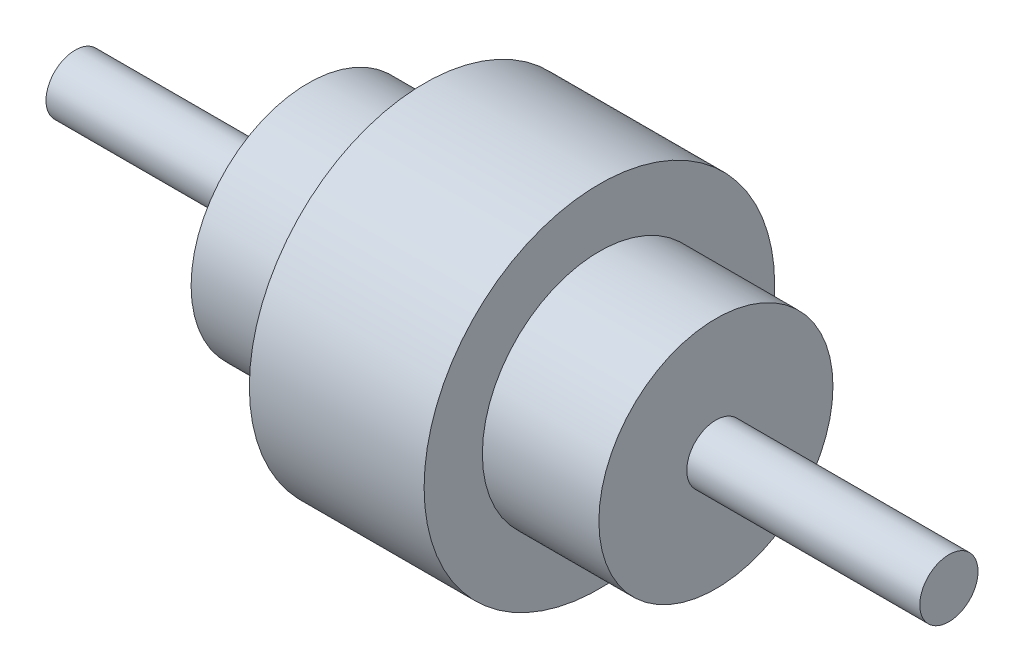
ISO-10303-21;
HEADER;
FILE_DESCRIPTION(('STEP AP214'),'2;1');
FILE_NAME('part.step','',(''),(''),'','','');
FILE_SCHEMA(('AUTOMOTIVE_DESIGN { 1 0 10303 214 1 1 1 1 }'));
ENDSEC;
DATA;
#1=APPLICATION_CONTEXT('core data for automotive mechanical design processes');
#2=APPLICATION_PROTOCOL_DEFINITION('international standard','automotive_design',2000,#1);
#3=PRODUCT_CONTEXT('',#1,'mechanical');
#4=PRODUCT('Part','Part','',(#3));
#5=PRODUCT_RELATED_PRODUCT_CATEGORY('part','',(#4));
#6=PRODUCT_DEFINITION_FORMATION('','',#4);
#7=PRODUCT_DEFINITION_CONTEXT('part definition',#1,'design');
#8=PRODUCT_DEFINITION('design','',#6,#7);
#9=PRODUCT_DEFINITION_SHAPE('','',#8);
#10=(LENGTH_UNIT() NAMED_UNIT(*) SI_UNIT(.MILLI.,.METRE.));
#11=(NAMED_UNIT(*) PLANE_ANGLE_UNIT() SI_UNIT($,.RADIAN.));
#12=(NAMED_UNIT(*) SI_UNIT($,.STERADIAN.) SOLID_ANGLE_UNIT());
#13=UNCERTAINTY_MEASURE_WITH_UNIT(LENGTH_MEASURE(1.E-05),#10,'distance_accuracy_value','');
#14=(GEOMETRIC_REPRESENTATION_CONTEXT(3) GLOBAL_UNCERTAINTY_ASSIGNED_CONTEXT((#13)) GLOBAL_UNIT_ASSIGNED_CONTEXT((#10,
#11,#12)) REPRESENTATION_CONTEXT('',''));
#15=CARTESIAN_POINT('',(0.,0.,0.));
#16=DIRECTION('',(0.,0.,1.));
#17=DIRECTION('',(1.,0.,0.));
#18=AXIS2_PLACEMENT_3D('',#15,#16,#17);
#19=CARTESIAN_POINT('',(-112.173913043478,4.72049689440994,0.));
#20=DIRECTION('',(-1.,0.,0.));
#21=DIRECTION('',(0.,0.,1.));
#22=AXIS2_PLACEMENT_3D('',#19,#20,#21);
#23=PLANE('',#22);
#24=CARTESIAN_POINT('',(-112.173913043478,4.72049689440994,0.));
#25=DIRECTION('',(-1.,0.,0.));
#26=DIRECTION('',(0.,0.,1.));
#27=AXIS2_PLACEMENT_3D('',#24,#25,#26);
#28=CIRCLE('',#27,10.);
#29=CARTESIAN_POINT('',(-112.173913043478,4.72049689440994,10.));
#30=VERTEX_POINT('',#29);
#31=EDGE_CURVE('E59',#30,#30,#28,.T.);
#32=ORIENTED_EDGE('',*,*,#31,.T.);
#33=EDGE_LOOP('',(#32));
#34=FACE_BOUND('',#33,.T.);
#35=ADVANCED_FACE('F32',(#34),#23,.T.);
#36=CARTESIAN_POINT('',(-127.826086956522,4.72049689440994,0.));
#37=DIRECTION('',(-1.,0.,0.));
#38=DIRECTION('',(0.,0.,1.));
#39=AXIS2_PLACEMENT_3D('',#36,#37,#38);
#40=CYLINDRICAL_SURFACE('',#39,10.);
#41=CARTESIAN_POINT('',(-32.1739130434782,4.72049689440994,0.));
#42=DIRECTION('',(-1.,0.,0.));
#43=DIRECTION('',(0.,0.,1.));
#44=AXIS2_PLACEMENT_3D('',#41,#42,#43);
#45=CIRCLE('',#44,10.);
#46=CARTESIAN_POINT('',(-32.1739130434782,4.72049689440994,10.));
#47=VERTEX_POINT('',#46);
#48=EDGE_CURVE('E62',#47,#47,#45,.T.);
#49=ORIENTED_EDGE('',*,*,#48,.T.);
#50=EDGE_LOOP('',(#49));
#51=FACE_BOUND('',#50,.T.);
#52=ORIENTED_EDGE('',*,*,#31,.F.);
#53=EDGE_LOOP('',(#52));
#54=FACE_BOUND('',#53,.T.);
#55=ADVANCED_FACE('F103',(#51,#54),#40,.T.);
#56=CARTESIAN_POINT('',(-32.1739130434782,14.7204968944099,0.));
#57=DIRECTION('',(-1.,0.,0.));
#58=DIRECTION('',(0.,0.,1.));
#59=AXIS2_PLACEMENT_3D('',#56,#57,#58);
#60=PLANE('',#59);
#61=CARTESIAN_POINT('',(-32.1739130434782,4.72049689440994,0.));
#62=DIRECTION('',(-1.,0.,0.));
#63=DIRECTION('',(0.,0.,1.));
#64=AXIS2_PLACEMENT_3D('',#61,#62,#63);
#65=CIRCLE('',#64,40.1863354037267);
#66=CARTESIAN_POINT('',(-32.1739130434782,4.72049689440994,40.1863354037267));
#67=VERTEX_POINT('',#66);
#68=EDGE_CURVE('E65',#67,#67,#65,.T.);
#69=ORIENTED_EDGE('',*,*,#68,.T.);
#70=EDGE_LOOP('',(#69));
#71=FACE_BOUND('',#70,.T.);
#72=ORIENTED_EDGE('',*,*,#48,.F.);
#73=EDGE_LOOP('',(#72));
#74=FACE_BOUND('',#73,.T.);
#75=ADVANCED_FACE('F109',(#71,#74),#60,.T.);
#76=CARTESIAN_POINT('',(-127.826086956522,4.72049689440994,0.));
#77=DIRECTION('',(-1.,0.,0.));
#78=DIRECTION('',(0.,0.,1.));
#79=AXIS2_PLACEMENT_3D('',#76,#77,#78);
#80=CYLINDRICAL_SURFACE('',#79,40.1863354037267);
#81=CARTESIAN_POINT('',(7.82608695652173,4.72049689440994,0.));
#82=DIRECTION('',(-1.,0.,0.));
#83=DIRECTION('',(0.,0.,1.));
#84=AXIS2_PLACEMENT_3D('',#81,#82,#83);
#85=CIRCLE('',#84,40.1863354037267);
#86=CARTESIAN_POINT('',(7.82608695652173,4.72049689440994,40.1863354037267));
#87=VERTEX_POINT('',#86);
#88=EDGE_CURVE('E68',#87,#87,#85,.T.);
#89=ORIENTED_EDGE('',*,*,#88,.T.);
#90=EDGE_LOOP('',(#89));
#91=FACE_BOUND('',#90,.T.);
#92=ORIENTED_EDGE('',*,*,#68,.F.);
#93=EDGE_LOOP('',(#92));
#94=FACE_BOUND('',#93,.T.);
#95=ADVANCED_FACE('F234',(#91,#94),#80,.T.);
#96=CARTESIAN_POINT('',(7.82608695652174,44.9068322981367,0.));
#97=DIRECTION('',(-1.,0.,0.));
#98=DIRECTION('',(0.,0.,1.));
#99=AXIS2_PLACEMENT_3D('',#96,#97,#98);
#100=PLANE('',#99);
#101=CARTESIAN_POINT('',(7.82608695652173,4.72049689440994,0.));
#102=DIRECTION('',(-1.,0.,0.));
#103=DIRECTION('',(0.,0.,1.));
#104=AXIS2_PLACEMENT_3D('',#101,#102,#103);
#105=CIRCLE('',#104,60.1863354037267);
#106=CARTESIAN_POINT('',(7.82608695652173,4.72049689440994,60.1863354037267));
#107=VERTEX_POINT('',#106);
#108=EDGE_CURVE('E71',#107,#107,#105,.T.);
#109=ORIENTED_EDGE('',*,*,#108,.T.);
#110=EDGE_LOOP('',(#109));
#111=FACE_BOUND('',#110,.T.);
#112=ORIENTED_EDGE('',*,*,#88,.F.);
#113=EDGE_LOOP('',(#112));
#114=FACE_BOUND('',#113,.T.);
#115=ADVANCED_FACE('F224',(#111,#114),#100,.T.);
#116=CARTESIAN_POINT('',(-127.826086956522,4.72049689440994,0.));
#117=DIRECTION('',(-1.,0.,0.));
#118=DIRECTION('',(0.,0.,1.));
#119=AXIS2_PLACEMENT_3D('',#116,#117,#118);
#120=CYLINDRICAL_SURFACE('',#119,60.1863354037267);
#121=CARTESIAN_POINT('',(67.8260869565218,4.72049689440994,0.));
#122=DIRECTION('',(-1.,0.,0.));
#123=DIRECTION('',(0.,0.,1.));
#124=AXIS2_PLACEMENT_3D('',#121,#122,#123);
#125=CIRCLE('',#124,60.1863354037267);
#126=CARTESIAN_POINT('',(67.8260869565218,4.72049689440994,60.1863354037267));
#127=VERTEX_POINT('',#126);
#128=EDGE_CURVE('E74',#127,#127,#125,.T.);
#129=ORIENTED_EDGE('',*,*,#128,.T.);
#130=EDGE_LOOP('',(#129));
#131=FACE_BOUND('',#130,.T.);
#132=ORIENTED_EDGE('',*,*,#108,.F.);
#133=EDGE_LOOP('',(#132));
#134=FACE_BOUND('',#133,.T.);
#135=ADVANCED_FACE('F214',(#131,#134),#120,.T.);
#136=CARTESIAN_POINT('',(67.8260869565217,64.9068322981366,0.));
#137=DIRECTION('',(1.,0.,0.));
#138=DIRECTION('',(0.,0.,-1.));
#139=AXIS2_PLACEMENT_3D('',#136,#137,#138);
#140=PLANE('',#139);
#141=CARTESIAN_POINT('',(67.8260869565218,4.72049689440994,0.));
#142=DIRECTION('',(-1.,0.,0.));
#143=DIRECTION('',(0.,0.,1.));
#144=AXIS2_PLACEMENT_3D('',#141,#142,#143);
#145=CIRCLE('',#144,40.1863354037267);
#146=CARTESIAN_POINT('',(67.8260869565218,4.72049689440994,40.1863354037267));
#147=VERTEX_POINT('',#146);
#148=EDGE_CURVE('E77',#147,#147,#145,.T.);
#149=ORIENTED_EDGE('',*,*,#148,.T.);
#150=EDGE_LOOP('',(#149));
#151=FACE_BOUND('',#150,.T.);
#152=ORIENTED_EDGE('',*,*,#128,.F.);
#153=EDGE_LOOP('',(#152));
#154=FACE_BOUND('',#153,.T.);
#155=ADVANCED_FACE('F204',(#151,#154),#140,.T.);
#156=CARTESIAN_POINT('',(-127.826086956522,4.72049689440994,0.));
#157=DIRECTION('',(-1.,0.,0.));
#158=DIRECTION('',(0.,0.,1.));
#159=AXIS2_PLACEMENT_3D('',#156,#157,#158);
#160=CYLINDRICAL_SURFACE('',#159,40.1863354037267);
#161=CARTESIAN_POINT('',(107.826086956522,4.72049689440994,0.));
#162=DIRECTION('',(-1.,0.,0.));
#163=DIRECTION('',(0.,0.,1.));
#164=AXIS2_PLACEMENT_3D('',#161,#162,#163);
#165=CIRCLE('',#164,40.1863354037267);
#166=CARTESIAN_POINT('',(107.826086956522,4.72049689440994,40.1863354037267));
#167=VERTEX_POINT('',#166);
#168=EDGE_CURVE('E80',#167,#167,#165,.T.);
#169=ORIENTED_EDGE('',*,*,#168,.T.);
#170=EDGE_LOOP('',(#169));
#171=FACE_BOUND('',#170,.T.);
#172=ORIENTED_EDGE('',*,*,#148,.F.);
#173=EDGE_LOOP('',(#172));
#174=FACE_BOUND('',#173,.T.);
#175=ADVANCED_FACE('F194',(#171,#174),#160,.T.);
#176=CARTESIAN_POINT('',(107.826086956522,44.9068322981367,0.));
#177=DIRECTION('',(1.,0.,0.));
#178=DIRECTION('',(0.,0.,-1.));
#179=AXIS2_PLACEMENT_3D('',#176,#177,#178);
#180=PLANE('',#179);
#181=CARTESIAN_POINT('',(107.826086956522,4.72049689440994,0.));
#182=DIRECTION('',(-1.,0.,0.));
#183=DIRECTION('',(0.,0.,1.));
#184=AXIS2_PLACEMENT_3D('',#181,#182,#183);
#185=CIRCLE('',#184,10.);
#186=CARTESIAN_POINT('',(107.826086956522,4.72049689440994,10.));
#187=VERTEX_POINT('',#186);
#188=EDGE_CURVE('E83',#187,#187,#185,.T.);
#189=ORIENTED_EDGE('',*,*,#188,.T.);
#190=EDGE_LOOP('',(#189));
#191=FACE_BOUND('',#190,.T.);
#192=ORIENTED_EDGE('',*,*,#168,.F.);
#193=EDGE_LOOP('',(#192));
#194=FACE_BOUND('',#193,.T.);
#195=ADVANCED_FACE('F100',(#191,#194),#180,.T.);
#196=CARTESIAN_POINT('',(-127.826086956522,4.72049689440994,0.));
#197=DIRECTION('',(-1.,0.,0.));
#198=DIRECTION('',(0.,0.,1.));
#199=AXIS2_PLACEMENT_3D('',#196,#197,#198);
#200=CYLINDRICAL_SURFACE('',#199,10.);
#201=CARTESIAN_POINT('',(187.826086956522,4.72049689440994,0.));
#202=DIRECTION('',(-1.,0.,0.));
#203=DIRECTION('',(0.,0.,1.));
#204=AXIS2_PLACEMENT_3D('',#201,#202,#203);
#205=CIRCLE('',#204,10.);
#206=CARTESIAN_POINT('',(187.826086956522,4.72049689440994,10.));
#207=VERTEX_POINT('',#206);
#208=EDGE_CURVE('E86',#207,#207,#205,.T.);
#209=ORIENTED_EDGE('',*,*,#208,.T.);
#210=EDGE_LOOP('',(#209));
#211=FACE_BOUND('',#210,.T.);
#212=ORIENTED_EDGE('',*,*,#188,.F.);
#213=EDGE_LOOP('',(#212));
#214=FACE_BOUND('',#213,.T.);
#215=ADVANCED_FACE('F90',(#211,#214),#200,.T.);
#216=CARTESIAN_POINT('',(187.826086956522,14.7204968944099,0.));
#217=DIRECTION('',(1.,0.,0.));
#218=DIRECTION('',(0.,0.,-1.));
#219=AXIS2_PLACEMENT_3D('',#216,#217,#218);
#220=PLANE('',#219);
#221=ORIENTED_EDGE('',*,*,#208,.F.);
#222=EDGE_LOOP('',(#221));
#223=FACE_BOUND('',#222,.T.);
#224=ADVANCED_FACE('F93',(#223),#220,.T.);
#225=CLOSED_SHELL('',(#35,#55,#75,#95,#115,#135,#155,#175,#195,#215,#224));
#226=CARTESIAN_POINT('',(97.8260869565217,44.9068322981366,0.));
#227=DIRECTION('',(1.,0.,0.));
#228=DIRECTION('',(0.,0.,-1.));
#229=AXIS2_PLACEMENT_3D('',#226,#227,#228);
#230=PLANE('',#229);
#231=CARTESIAN_POINT('',(97.8260869565217,4.72049689440994,0.));
#232=DIRECTION('',(-1.,0.,0.));
#233=DIRECTION('',(0.,0.,1.));
#234=AXIS2_PLACEMENT_3D('',#231,#232,#233);
#235=CIRCLE('',#234,30.1863354037267);
#236=CARTESIAN_POINT('',(97.8260869565217,4.72049689440994,30.1863354037267));
#237=VERTEX_POINT('',#236);
#238=EDGE_CURVE('E10',#237,#237,#235,.T.);
#239=ORIENTED_EDGE('',*,*,#238,.T.);
#240=EDGE_LOOP('',(#239));
#241=FACE_BOUND('',#240,.T.);
#242=ADVANCED_FACE('F34',(#241),#230,.F.);
#243=CARTESIAN_POINT('',(-127.826086956522,4.72049689440994,0.));
#244=DIRECTION('',(-1.,0.,0.));
#245=DIRECTION('',(0.,0.,1.));
#246=AXIS2_PLACEMENT_3D('',#243,#244,#245);
#247=CYLINDRICAL_SURFACE('',#246,30.1863354037267);
#248=ORIENTED_EDGE('',*,*,#238,.F.);
#249=EDGE_LOOP('',(#248));
#250=FACE_BOUND('',#249,.T.);
#251=CARTESIAN_POINT('',(57.8260869565217,4.72049689440994,0.));
#252=DIRECTION('',(-1.,0.,0.));
#253=DIRECTION('',(0.,0.,1.));
#254=AXIS2_PLACEMENT_3D('',#251,#252,#253);
#255=CIRCLE('',#254,30.1863354037267);
#256=CARTESIAN_POINT('',(57.8260869565217,4.72049689440994,30.1863354037267));
#257=VERTEX_POINT('',#256);
#258=EDGE_CURVE('E40',#257,#257,#255,.T.);
#259=ORIENTED_EDGE('',*,*,#258,.T.);
#260=EDGE_LOOP('',(#259));
#261=FACE_BOUND('',#260,.T.);
#262=ADVANCED_FACE('F133',(#250,#261),#247,.F.);
#263=CARTESIAN_POINT('',(57.8260869565217,64.9068322981366,0.));
#264=DIRECTION('',(1.,0.,0.));
#265=DIRECTION('',(0.,0.,-1.));
#266=AXIS2_PLACEMENT_3D('',#263,#264,#265);
#267=PLANE('',#266);
#268=ORIENTED_EDGE('',*,*,#258,.F.);
#269=EDGE_LOOP('',(#268));
#270=FACE_BOUND('',#269,.T.);
#271=CARTESIAN_POINT('',(57.8260869565217,4.72049689440994,0.));
#272=DIRECTION('',(-1.,0.,0.));
#273=DIRECTION('',(0.,0.,1.));
#274=AXIS2_PLACEMENT_3D('',#271,#272,#273);
#275=CIRCLE('',#274,50.1863354037267);
#276=CARTESIAN_POINT('',(57.8260869565217,4.72049689440994,50.1863354037267));
#277=VERTEX_POINT('',#276);
#278=EDGE_CURVE('E44',#277,#277,#275,.T.);
#279=ORIENTED_EDGE('',*,*,#278,.T.);
#280=EDGE_LOOP('',(#279));
#281=FACE_BOUND('',#280,.T.);
#282=ADVANCED_FACE('F130',(#270,#281),#267,.F.);
#283=CARTESIAN_POINT('',(-127.826086956522,4.72049689440994,0.));
#284=DIRECTION('',(-1.,0.,0.));
#285=DIRECTION('',(0.,0.,1.));
#286=AXIS2_PLACEMENT_3D('',#283,#284,#285);
#287=CYLINDRICAL_SURFACE('',#286,50.1863354037267);
#288=ORIENTED_EDGE('',*,*,#278,.F.);
#289=EDGE_LOOP('',(#288));
#290=FACE_BOUND('',#289,.T.);
#291=CARTESIAN_POINT('',(17.8260869565217,4.72049689440994,0.));
#292=DIRECTION('',(-1.,0.,0.));
#293=DIRECTION('',(0.,0.,1.));
#294=AXIS2_PLACEMENT_3D('',#291,#292,#293);
#295=CIRCLE('',#294,50.1863354037267);
#296=CARTESIAN_POINT('',(17.8260869565217,4.72049689440994,50.1863354037267));
#297=VERTEX_POINT('',#296);
#298=EDGE_CURVE('E48',#297,#297,#295,.T.);
#299=ORIENTED_EDGE('',*,*,#298,.T.);
#300=EDGE_LOOP('',(#299));
#301=FACE_BOUND('',#300,.T.);
#302=ADVANCED_FACE('F126',(#290,#301),#287,.F.);
#303=CARTESIAN_POINT('',(17.8260869565217,44.9068322981367,0.));
#304=DIRECTION('',(-1.,0.,0.));
#305=DIRECTION('',(0.,0.,1.));
#306=AXIS2_PLACEMENT_3D('',#303,#304,#305);
#307=PLANE('',#306);
#308=ORIENTED_EDGE('',*,*,#298,.F.);
#309=EDGE_LOOP('',(#308));
#310=FACE_BOUND('',#309,.T.);
#311=CARTESIAN_POINT('',(17.8260869565217,4.72049689440994,0.));
#312=DIRECTION('',(-1.,0.,0.));
#313=DIRECTION('',(0.,0.,1.));
#314=AXIS2_PLACEMENT_3D('',#311,#312,#313);
#315=CIRCLE('',#314,30.1863354037267);
#316=CARTESIAN_POINT('',(17.8260869565217,4.72049689440994,30.1863354037267));
#317=VERTEX_POINT('',#316);
#318=EDGE_CURVE('E53',#317,#317,#315,.T.);
#319=ORIENTED_EDGE('',*,*,#318,.T.);
#320=EDGE_LOOP('',(#319));
#321=FACE_BOUND('',#320,.T.);
#322=ADVANCED_FACE('F122',(#310,#321),#307,.F.);
#323=CARTESIAN_POINT('',(-127.826086956522,4.72049689440994,0.));
#324=DIRECTION('',(-1.,0.,0.));
#325=DIRECTION('',(0.,0.,1.));
#326=AXIS2_PLACEMENT_3D('',#323,#324,#325);
#327=CYLINDRICAL_SURFACE('',#326,30.1863354037267);
#328=ORIENTED_EDGE('',*,*,#318,.F.);
#329=EDGE_LOOP('',(#328));
#330=FACE_BOUND('',#329,.T.);
#331=CARTESIAN_POINT('',(-22.1739130434782,4.72049689440994,0.));
#332=DIRECTION('',(-1.,0.,0.));
#333=DIRECTION('',(0.,0.,1.));
#334=AXIS2_PLACEMENT_3D('',#331,#332,#333);
#335=CIRCLE('',#334,30.1863354037267);
#336=CARTESIAN_POINT('',(-22.1739130434782,4.72049689440994,30.1863354037267));
#337=VERTEX_POINT('',#336);
#338=EDGE_CURVE('E56',#337,#337,#335,.T.);
#339=ORIENTED_EDGE('',*,*,#338,.T.);
#340=EDGE_LOOP('',(#339));
#341=FACE_BOUND('',#340,.T.);
#342=ADVANCED_FACE('F117',(#330,#341),#327,.F.);
#343=CARTESIAN_POINT('',(-22.1739130434782,14.7204968944099,0.));
#344=DIRECTION('',(-1.,0.,0.));
#345=DIRECTION('',(0.,0.,1.));
#346=AXIS2_PLACEMENT_3D('',#343,#344,#345);
#347=PLANE('',#346);
#348=ORIENTED_EDGE('',*,*,#338,.F.);
#349=EDGE_LOOP('',(#348));
#350=FACE_BOUND('',#349,.T.);
#351=ADVANCED_FACE('F114',(#350),#347,.F.);
#352=CLOSED_SHELL('',(#242,#262,#282,#302,#322,#342,#351));
#353=ORIENTED_CLOSED_SHELL('',*,#352,.T.);
#354=BREP_WITH_VOIDS('B2',#225,(#353));
#355=ADVANCED_BREP_SHAPE_REPRESENTATION('',(#18,#354),#14);
#356=SHAPE_DEFINITION_REPRESENTATION(#9,#355);
ENDSEC;
END-ISO-10303-21;
